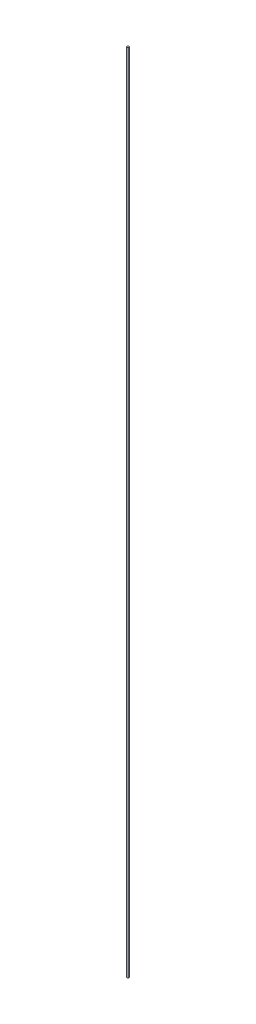
ISO-10303-21;
HEADER;
FILE_DESCRIPTION(('STEP AP214'),'2;1');
FILE_NAME('part.step','',(''),(''),'','','');
FILE_SCHEMA(('AUTOMOTIVE_DESIGN { 1 0 10303 214 1 1 1 1 }'));
ENDSEC;
DATA;
#1=APPLICATION_CONTEXT('core data for automotive mechanical design processes');
#2=APPLICATION_PROTOCOL_DEFINITION('international standard','automotive_design',2000,#1);
#3=PRODUCT_CONTEXT('',#1,'mechanical');
#4=PRODUCT('Part','Part','',(#3));
#5=PRODUCT_RELATED_PRODUCT_CATEGORY('part','',(#4));
#6=PRODUCT_DEFINITION_FORMATION('','',#4);
#7=PRODUCT_DEFINITION_CONTEXT('part definition',#1,'design');
#8=PRODUCT_DEFINITION('design','',#6,#7);
#9=PRODUCT_DEFINITION_SHAPE('','',#8);
#10=(LENGTH_UNIT() NAMED_UNIT(*) SI_UNIT(.MILLI.,.METRE.));
#11=(NAMED_UNIT(*) PLANE_ANGLE_UNIT() SI_UNIT($,.RADIAN.));
#12=(NAMED_UNIT(*) SI_UNIT($,.STERADIAN.) SOLID_ANGLE_UNIT());
#13=UNCERTAINTY_MEASURE_WITH_UNIT(LENGTH_MEASURE(1.E-05),#10,'distance_accuracy_value','');
#14=(GEOMETRIC_REPRESENTATION_CONTEXT(3) GLOBAL_UNCERTAINTY_ASSIGNED_CONTEXT((#13)) GLOBAL_UNIT_ASSIGNED_CONTEXT((#10,
#11,#12)) REPRESENTATION_CONTEXT('',''));
#15=CARTESIAN_POINT('',(0.,0.,0.));
#16=DIRECTION('',(0.,0.,1.));
#17=DIRECTION('',(1.,0.,0.));
#18=AXIS2_PLACEMENT_3D('',#15,#16,#17);
#19=CARTESIAN_POINT('',(0.,914.4,0.));
#20=DIRECTION('',(0.,-1.,0.));
#21=DIRECTION('',(0.,0.,-1.));
#22=AXIS2_PLACEMENT_3D('',#19,#20,#21);
#23=CYLINDRICAL_SURFACE('',#22,1.016);
#24=CARTESIAN_POINT('',(0.,914.4,0.));
#25=DIRECTION('',(0.,1.,0.));
#26=DIRECTION('',(0.,0.,1.));
#27=AXIS2_PLACEMENT_3D('',#24,#25,#26);
#28=CIRCLE('',#27,1.016);
#29=CARTESIAN_POINT('',(0.,914.4,1.016));
#30=VERTEX_POINT('',#29);
#31=EDGE_CURVE('E10',#30,#30,#28,.T.);
#32=ORIENTED_EDGE('',*,*,#31,.F.);
#33=EDGE_LOOP('',(#32));
#34=FACE_BOUND('',#33,.T.);
#35=CARTESIAN_POINT('',(0.,0.,0.));
#36=DIRECTION('',(0.,1.,0.));
#37=DIRECTION('',(0.,0.,1.));
#38=AXIS2_PLACEMENT_3D('',#35,#36,#37);
#39=CIRCLE('',#38,1.016);
#40=CARTESIAN_POINT('',(0.,0.,1.016));
#41=VERTEX_POINT('',#40);
#42=EDGE_CURVE('E35',#41,#41,#39,.T.);
#43=ORIENTED_EDGE('',*,*,#42,.T.);
#44=EDGE_LOOP('',(#43));
#45=FACE_BOUND('',#44,.T.);
#46=ADVANCED_FACE('F32',(#34,#45),#23,.T.);
#47=CARTESIAN_POINT('',(0.,914.4,0.));
#48=DIRECTION('',(0.,1.,0.));
#49=DIRECTION('',(0.,0.,1.));
#50=AXIS2_PLACEMENT_3D('',#47,#48,#49);
#51=PLANE('',#50);
#52=ORIENTED_EDGE('',*,*,#31,.T.);
#53=EDGE_LOOP('',(#52));
#54=FACE_BOUND('',#53,.T.);
#55=ADVANCED_FACE('F47',(#54),#51,.T.);
#56=CARTESIAN_POINT('',(0.,0.,0.));
#57=DIRECTION('',(0.,1.,0.));
#58=DIRECTION('',(0.,0.,1.));
#59=AXIS2_PLACEMENT_3D('',#56,#57,#58);
#60=PLANE('',#59);
#61=ORIENTED_EDGE('',*,*,#42,.F.);
#62=EDGE_LOOP('',(#61));
#63=FACE_BOUND('',#62,.T.);
#64=ADVANCED_FACE('F45',(#63),#60,.F.);
#65=CLOSED_SHELL('',(#46,#55,#64));
#66=MANIFOLD_SOLID_BREP('B2',#65);
#67=ADVANCED_BREP_SHAPE_REPRESENTATION('',(#18,#66),#14);
#68=SHAPE_DEFINITION_REPRESENTATION(#9,#67);
ENDSEC;
END-ISO-10303-21;
